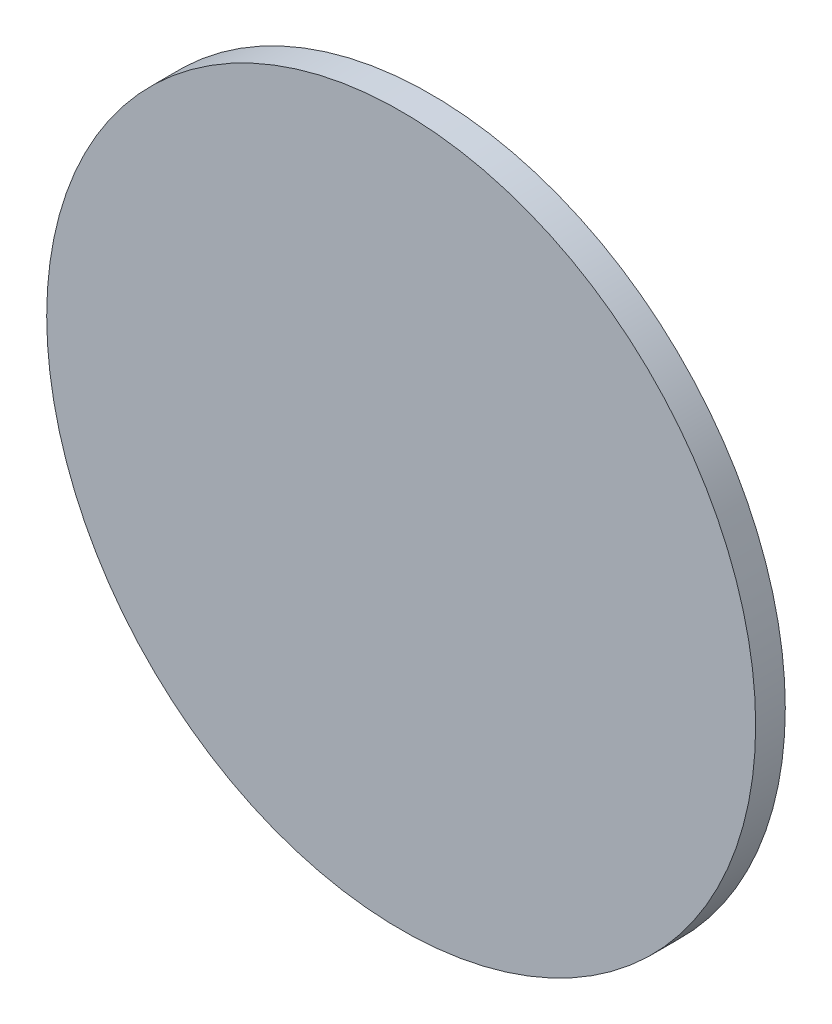
ISO-10303-21;
HEADER;
FILE_DESCRIPTION(('STEP AP214'),'2;1');
FILE_NAME('part.step','',(''),(''),'','','');
FILE_SCHEMA(('AUTOMOTIVE_DESIGN { 1 0 10303 214 1 1 1 1 }'));
ENDSEC;
DATA;
#1=APPLICATION_CONTEXT('core data for automotive mechanical design processes');
#2=APPLICATION_PROTOCOL_DEFINITION('international standard','automotive_design',2000,#1);
#3=PRODUCT_CONTEXT('',#1,'mechanical');
#4=PRODUCT('Part','Part','',(#3));
#5=PRODUCT_RELATED_PRODUCT_CATEGORY('part','',(#4));
#6=PRODUCT_DEFINITION_FORMATION('','',#4);
#7=PRODUCT_DEFINITION_CONTEXT('part definition',#1,'design');
#8=PRODUCT_DEFINITION('design','',#6,#7);
#9=PRODUCT_DEFINITION_SHAPE('','',#8);
#10=(LENGTH_UNIT() NAMED_UNIT(*) SI_UNIT(.MILLI.,.METRE.));
#11=(NAMED_UNIT(*) PLANE_ANGLE_UNIT() SI_UNIT($,.RADIAN.));
#12=(NAMED_UNIT(*) SI_UNIT($,.STERADIAN.) SOLID_ANGLE_UNIT());
#13=UNCERTAINTY_MEASURE_WITH_UNIT(LENGTH_MEASURE(1.E-05),#10,'distance_accuracy_value','');
#14=(GEOMETRIC_REPRESENTATION_CONTEXT(3) GLOBAL_UNCERTAINTY_ASSIGNED_CONTEXT((#13)) GLOBAL_UNIT_ASSIGNED_CONTEXT((#10,
#11,#12)) REPRESENTATION_CONTEXT('',''));
#15=CARTESIAN_POINT('',(0.,0.,0.));
#16=DIRECTION('',(0.,0.,1.));
#17=DIRECTION('',(1.,0.,0.));
#18=AXIS2_PLACEMENT_3D('',#15,#16,#17);
#19=CARTESIAN_POINT('',(0.,0.,6.35));
#20=DIRECTION('',(0.,0.,-1.));
#21=DIRECTION('',(-1.,0.,0.));
#22=AXIS2_PLACEMENT_3D('',#19,#20,#21);
#23=CYLINDRICAL_SURFACE('',#22,75.946);
#24=CARTESIAN_POINT('',(0.,0.,6.35));
#25=DIRECTION('',(0.,0.,1.));
#26=DIRECTION('',(1.,0.,0.));
#27=AXIS2_PLACEMENT_3D('',#24,#25,#26);
#28=CIRCLE('',#27,75.946);
#29=CARTESIAN_POINT('',(75.946,0.,6.35));
#30=VERTEX_POINT('',#29);
#31=EDGE_CURVE('E10',#30,#30,#28,.T.);
#32=ORIENTED_EDGE('',*,*,#31,.F.);
#33=EDGE_LOOP('',(#32));
#34=FACE_BOUND('',#33,.T.);
#35=CARTESIAN_POINT('',(0.,0.,0.));
#36=DIRECTION('',(0.,0.,1.));
#37=DIRECTION('',(1.,0.,0.));
#38=AXIS2_PLACEMENT_3D('',#35,#36,#37);
#39=CIRCLE('',#38,75.946);
#40=CARTESIAN_POINT('',(75.946,0.,0.));
#41=VERTEX_POINT('',#40);
#42=EDGE_CURVE('E46',#41,#41,#39,.T.);
#43=ORIENTED_EDGE('',*,*,#42,.T.);
#44=EDGE_LOOP('',(#43));
#45=FACE_BOUND('',#44,.T.);
#46=ADVANCED_FACE('F43',(#34,#45),#23,.T.);
#47=CARTESIAN_POINT('',(0.,0.,6.35));
#48=DIRECTION('',(0.,0.,1.));
#49=DIRECTION('',(1.,0.,0.));
#50=AXIS2_PLACEMENT_3D('',#47,#48,#49);
#51=PLANE('',#50);
#52=ORIENTED_EDGE('',*,*,#31,.T.);
#53=EDGE_LOOP('',(#52));
#54=FACE_BOUND('',#53,.T.);
#55=ADVANCED_FACE('F60',(#54),#51,.T.);
#56=CARTESIAN_POINT('',(0.,0.,0.));
#57=DIRECTION('',(0.,0.,1.));
#58=DIRECTION('',(1.,0.,0.));
#59=AXIS2_PLACEMENT_3D('',#56,#57,#58);
#60=PLANE('',#59);
#61=ORIENTED_EDGE('',*,*,#42,.F.);
#62=EDGE_LOOP('',(#61));
#63=FACE_BOUND('',#62,.T.);
#64=ADVANCED_FACE('F58',(#63),#60,.F.);
#65=CLOSED_SHELL('',(#46,#55,#64));
#66=MANIFOLD_SOLID_BREP('B2',#65);
#67=ADVANCED_BREP_SHAPE_REPRESENTATION('',(#18,#66),#14);
#68=SHAPE_DEFINITION_REPRESENTATION(#9,#67);
ENDSEC;
END-ISO-10303-21;
